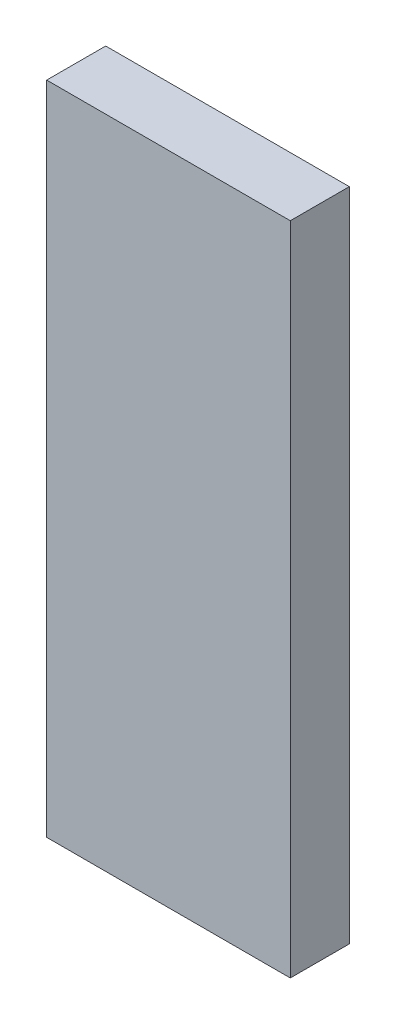
ISO-10303-21;
HEADER;
FILE_DESCRIPTION(('STEP AP214'),'2;1');
FILE_NAME('part.step','',(''),(''),'','','');
FILE_SCHEMA(('AUTOMOTIVE_DESIGN { 1 0 10303 214 1 1 1 1 }'));
ENDSEC;
DATA;
#1=APPLICATION_CONTEXT('core data for automotive mechanical design processes');
#2=APPLICATION_PROTOCOL_DEFINITION('international standard','automotive_design',2000,#1);
#3=PRODUCT_CONTEXT('',#1,'mechanical');
#4=PRODUCT('Part','Part','',(#3));
#5=PRODUCT_RELATED_PRODUCT_CATEGORY('part','',(#4));
#6=PRODUCT_DEFINITION_FORMATION('','',#4);
#7=PRODUCT_DEFINITION_CONTEXT('part definition',#1,'design');
#8=PRODUCT_DEFINITION('design','',#6,#7);
#9=PRODUCT_DEFINITION_SHAPE('','',#8);
#10=(LENGTH_UNIT() NAMED_UNIT(*) SI_UNIT(.MILLI.,.METRE.));
#11=(NAMED_UNIT(*) PLANE_ANGLE_UNIT() SI_UNIT($,.RADIAN.));
#12=(NAMED_UNIT(*) SI_UNIT($,.STERADIAN.) SOLID_ANGLE_UNIT());
#13=UNCERTAINTY_MEASURE_WITH_UNIT(LENGTH_MEASURE(1.E-05),#10,'distance_accuracy_value','');
#14=(GEOMETRIC_REPRESENTATION_CONTEXT(3) GLOBAL_UNCERTAINTY_ASSIGNED_CONTEXT((#13)) GLOBAL_UNIT_ASSIGNED_CONTEXT((#10,
#11,#12)) REPRESENTATION_CONTEXT('',''));
#15=CARTESIAN_POINT('',(0.,0.,0.));
#16=DIRECTION('',(0.,0.,1.));
#17=DIRECTION('',(1.,0.,0.));
#18=AXIS2_PLACEMENT_3D('',#15,#16,#17);
#19=CARTESIAN_POINT('',(0.,0.,4.));
#20=DIRECTION('',(1.,0.,0.));
#21=DIRECTION('',(0.,0.,-1.));
#22=AXIS2_PLACEMENT_3D('',#19,#20,#21);
#23=PLANE('',#22);
#24=DIRECTION('',(0.,-1.,0.));
#25=VECTOR('',#24,1.);
#26=CARTESIAN_POINT('',(0.,0.,0.));
#27=LINE('',#26,#25);
#28=CARTESIAN_POINT('',(0.,44.45,0.));
#29=VERTEX_POINT('',#28);
#30=CARTESIAN_POINT('',(0.,0.,0.));
#31=VERTEX_POINT('',#30);
#32=EDGE_CURVE('E96',#29,#31,#27,.T.);
#33=ORIENTED_EDGE('',*,*,#32,.T.);
#34=DIRECTION('',(0.,0.,-1.));
#35=VECTOR('',#34,1.);
#36=CARTESIAN_POINT('',(0.,0.,4.));
#37=LINE('',#36,#35);
#38=CARTESIAN_POINT('',(0.,0.,4.));
#39=VERTEX_POINT('',#38);
#40=EDGE_CURVE('E11',#39,#31,#37,.T.);
#41=ORIENTED_EDGE('',*,*,#40,.F.);
#42=DIRECTION('',(0.,-1.,0.));
#43=VECTOR('',#42,1.);
#44=CARTESIAN_POINT('',(0.,0.,4.));
#45=LINE('',#44,#43);
#46=CARTESIAN_POINT('',(0.,44.45,4.));
#47=VERTEX_POINT('',#46);
#48=EDGE_CURVE('E84',#47,#39,#45,.T.);
#49=ORIENTED_EDGE('',*,*,#48,.F.);
#50=DIRECTION('',(0.,0.,-1.));
#51=VECTOR('',#50,1.);
#52=CARTESIAN_POINT('',(0.,44.45,4.));
#53=LINE('',#52,#51);
#54=EDGE_CURVE('E92',#47,#29,#53,.T.);
#55=ORIENTED_EDGE('',*,*,#54,.T.);
#56=EDGE_LOOP('',(#33,#41,#49,#55));
#57=FACE_BOUND('',#56,.T.);
#58=ADVANCED_FACE('F33',(#57),#23,.F.);
#59=CARTESIAN_POINT('',(0.,0.,4.));
#60=DIRECTION('',(0.,1.,0.));
#61=DIRECTION('',(0.,0.,1.));
#62=AXIS2_PLACEMENT_3D('',#59,#60,#61);
#63=PLANE('',#62);
#64=DIRECTION('',(1.,0.,0.));
#65=VECTOR('',#64,1.);
#66=CARTESIAN_POINT('',(0.,0.,0.));
#67=LINE('',#66,#65);
#68=CARTESIAN_POINT('',(16.51,0.,0.));
#69=VERTEX_POINT('',#68);
#70=EDGE_CURVE('E88',#31,#69,#67,.T.);
#71=ORIENTED_EDGE('',*,*,#70,.T.);
#72=DIRECTION('',(0.,0.,-1.));
#73=VECTOR('',#72,1.);
#74=CARTESIAN_POINT('',(16.51,0.,4.));
#75=LINE('',#74,#73);
#76=CARTESIAN_POINT('',(16.51,0.,4.));
#77=VERTEX_POINT('',#76);
#78=EDGE_CURVE('E41',#77,#69,#75,.T.);
#79=ORIENTED_EDGE('',*,*,#78,.F.);
#80=DIRECTION('',(1.,0.,0.));
#81=VECTOR('',#80,1.);
#82=CARTESIAN_POINT('',(0.,0.,4.));
#83=LINE('',#82,#81);
#84=EDGE_CURVE('E79',#39,#77,#83,.T.);
#85=ORIENTED_EDGE('',*,*,#84,.F.);
#86=ORIENTED_EDGE('',*,*,#40,.T.);
#87=EDGE_LOOP('',(#71,#79,#85,#86));
#88=FACE_BOUND('',#87,.T.);
#89=ADVANCED_FACE('F87',(#88),#63,.F.);
#90=CARTESIAN_POINT('',(16.51,0.,4.));
#91=DIRECTION('',(-1.,0.,0.));
#92=DIRECTION('',(0.,0.,1.));
#93=AXIS2_PLACEMENT_3D('',#90,#91,#92);
#94=PLANE('',#93);
#95=DIRECTION('',(0.,1.,0.));
#96=VECTOR('',#95,1.);
#97=CARTESIAN_POINT('',(16.51,0.,0.));
#98=LINE('',#97,#96);
#99=CARTESIAN_POINT('',(16.51,44.45,0.));
#100=VERTEX_POINT('',#99);
#101=EDGE_CURVE('E66',#69,#100,#98,.T.);
#102=ORIENTED_EDGE('',*,*,#101,.T.);
#103=DIRECTION('',(0.,0.,-1.));
#104=VECTOR('',#103,1.);
#105=CARTESIAN_POINT('',(16.51,44.45,4.));
#106=LINE('',#105,#104);
#107=CARTESIAN_POINT('',(16.51,44.45,4.));
#108=VERTEX_POINT('',#107);
#109=EDGE_CURVE('E89',#108,#100,#106,.T.);
#110=ORIENTED_EDGE('',*,*,#109,.F.);
#111=DIRECTION('',(0.,1.,0.));
#112=VECTOR('',#111,1.);
#113=CARTESIAN_POINT('',(16.51,0.,4.));
#114=LINE('',#113,#112);
#115=EDGE_CURVE('E82',#77,#108,#114,.T.);
#116=ORIENTED_EDGE('',*,*,#115,.F.);
#117=ORIENTED_EDGE('',*,*,#78,.T.);
#118=EDGE_LOOP('',(#102,#110,#116,#117));
#119=FACE_BOUND('',#118,.T.);
#120=ADVANCED_FACE('F90',(#119),#94,.F.);
#121=CARTESIAN_POINT('',(0.,44.45,4.));
#122=DIRECTION('',(0.,-1.,0.));
#123=DIRECTION('',(0.,0.,-1.));
#124=AXIS2_PLACEMENT_3D('',#121,#122,#123);
#125=PLANE('',#124);
#126=DIRECTION('',(-1.,0.,0.));
#127=VECTOR('',#126,1.);
#128=CARTESIAN_POINT('',(0.,44.45,0.));
#129=LINE('',#128,#127);
#130=EDGE_CURVE('E72',#100,#29,#129,.T.);
#131=ORIENTED_EDGE('',*,*,#130,.T.);
#132=ORIENTED_EDGE('',*,*,#54,.F.);
#133=DIRECTION('',(-1.,0.,0.));
#134=VECTOR('',#133,1.);
#135=CARTESIAN_POINT('',(0.,44.45,4.));
#136=LINE('',#135,#134);
#137=EDGE_CURVE('E49',#108,#47,#136,.T.);
#138=ORIENTED_EDGE('',*,*,#137,.F.);
#139=ORIENTED_EDGE('',*,*,#109,.T.);
#140=EDGE_LOOP('',(#131,#132,#138,#139));
#141=FACE_BOUND('',#140,.T.);
#142=ADVANCED_FACE('F103',(#141),#125,.F.);
#143=CARTESIAN_POINT('',(0.,0.,4.));
#144=DIRECTION('',(0.,0.,-1.));
#145=DIRECTION('',(-1.,0.,0.));
#146=AXIS2_PLACEMENT_3D('',#143,#144,#145);
#147=PLANE('',#146);
#148=ORIENTED_EDGE('',*,*,#48,.T.);
#149=ORIENTED_EDGE('',*,*,#84,.T.);
#150=ORIENTED_EDGE('',*,*,#115,.T.);
#151=ORIENTED_EDGE('',*,*,#137,.T.);
#152=EDGE_LOOP('',(#148,#149,#150,#151));
#153=FACE_BOUND('',#152,.T.);
#154=ADVANCED_FACE('F80',(#153),#147,.F.);
#155=CARTESIAN_POINT('',(0.,0.,0.));
#156=DIRECTION('',(0.,0.,-1.));
#157=DIRECTION('',(-1.,0.,0.));
#158=AXIS2_PLACEMENT_3D('',#155,#156,#157);
#159=PLANE('',#158);
#160=ORIENTED_EDGE('',*,*,#32,.F.);
#161=ORIENTED_EDGE('',*,*,#130,.F.);
#162=ORIENTED_EDGE('',*,*,#101,.F.);
#163=ORIENTED_EDGE('',*,*,#70,.F.);
#164=EDGE_LOOP('',(#160,#161,#162,#163));
#165=FACE_BOUND('',#164,.T.);
#166=ADVANCED_FACE('F106',(#165),#159,.T.);
#167=CLOSED_SHELL('',(#58,#89,#120,#142,#154,#166));
#168=MANIFOLD_SOLID_BREP('B2',#167);
#169=ADVANCED_BREP_SHAPE_REPRESENTATION('',(#18,#168),#14);
#170=SHAPE_DEFINITION_REPRESENTATION(#9,#169);
ENDSEC;
END-ISO-10303-21;
